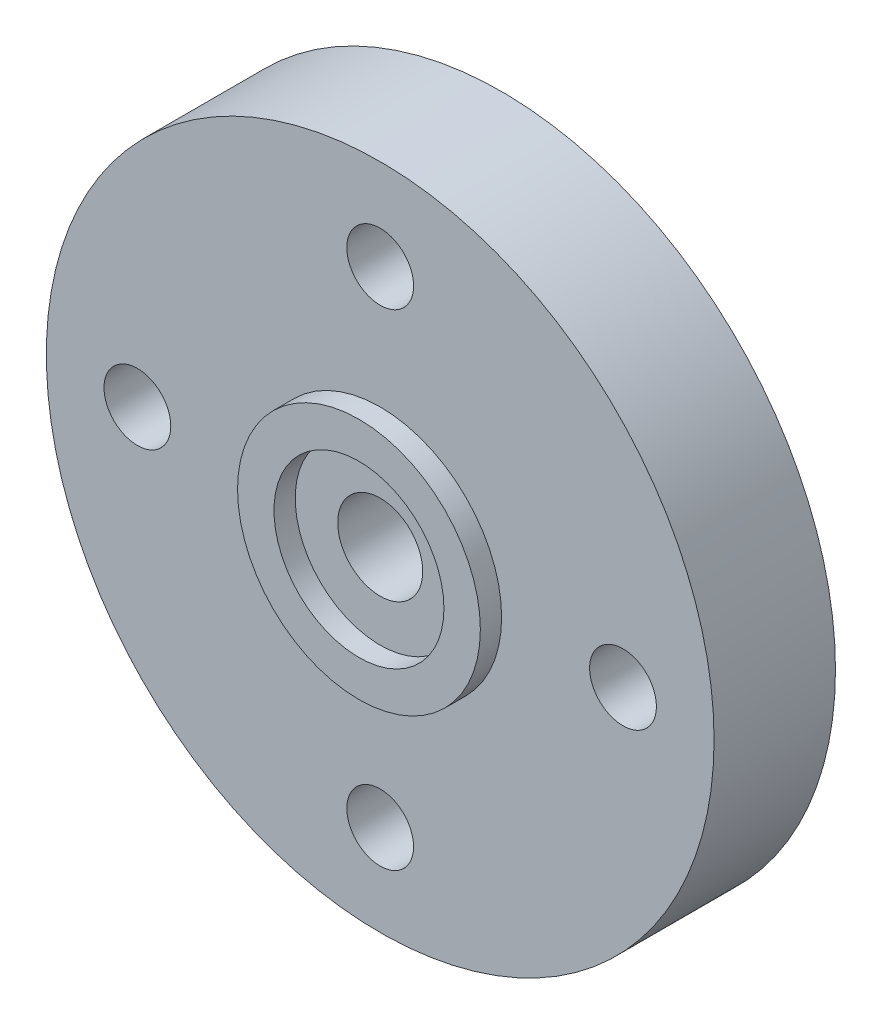
ISO-10303-21;
HEADER;
FILE_DESCRIPTION(('STEP AP214'),'2;1');
FILE_NAME('part.step','',(''),(''),'','','');
FILE_SCHEMA(('AUTOMOTIVE_DESIGN { 1 0 10303 214 1 1 1 1 }'));
ENDSEC;
DATA;
#1=APPLICATION_CONTEXT('core data for automotive mechanical design processes');
#2=APPLICATION_PROTOCOL_DEFINITION('international standard','automotive_design',2000,#1);
#3=PRODUCT_CONTEXT('',#1,'mechanical');
#4=PRODUCT('Part','Part','',(#3));
#5=PRODUCT_RELATED_PRODUCT_CATEGORY('part','',(#4));
#6=PRODUCT_DEFINITION_FORMATION('','',#4);
#7=PRODUCT_DEFINITION_CONTEXT('part definition',#1,'design');
#8=PRODUCT_DEFINITION('design','',#6,#7);
#9=PRODUCT_DEFINITION_SHAPE('','',#8);
#10=(LENGTH_UNIT() NAMED_UNIT(*) SI_UNIT(.MILLI.,.METRE.));
#11=(NAMED_UNIT(*) PLANE_ANGLE_UNIT() SI_UNIT($,.RADIAN.));
#12=(NAMED_UNIT(*) SI_UNIT($,.STERADIAN.) SOLID_ANGLE_UNIT());
#13=UNCERTAINTY_MEASURE_WITH_UNIT(LENGTH_MEASURE(1.E-05),#10,'distance_accuracy_value','');
#14=(GEOMETRIC_REPRESENTATION_CONTEXT(3) GLOBAL_UNCERTAINTY_ASSIGNED_CONTEXT((#13)) GLOBAL_UNIT_ASSIGNED_CONTEXT((#10,
#11,#12)) REPRESENTATION_CONTEXT('',''));
#15=CARTESIAN_POINT('',(0.,0.,0.));
#16=DIRECTION('',(0.,0.,1.));
#17=DIRECTION('',(1.,0.,0.));
#18=AXIS2_PLACEMENT_3D('',#15,#16,#17);
#19=CARTESIAN_POINT('',(0.,0.,4.));
#20=DIRECTION('',(0.,0.,1.));
#21=DIRECTION('',(1.,0.,0.));
#22=AXIS2_PLACEMENT_3D('',#19,#20,#21);
#23=PLANE('',#22);
#24=CARTESIAN_POINT('',(8.,0.,4.));
#25=DIRECTION('',(0.,0.,1.));
#26=DIRECTION('',(1.,0.,0.));
#27=AXIS2_PLACEMENT_3D('',#24,#25,#26);
#28=CIRCLE('',#27,1.1);
#29=CARTESIAN_POINT('',(9.1,0.,4.));
#30=VERTEX_POINT('',#29);
#31=EDGE_CURVE('E56',#30,#30,#28,.T.);
#32=ORIENTED_EDGE('',*,*,#31,.F.);
#33=EDGE_LOOP('',(#32));
#34=FACE_BOUND('',#33,.T.);
#35=CARTESIAN_POINT('',(0.,8.,4.));
#36=DIRECTION('',(0.,0.,1.));
#37=DIRECTION('',(1.,0.,0.));
#38=AXIS2_PLACEMENT_3D('',#35,#36,#37);
#39=CIRCLE('',#38,1.1);
#40=CARTESIAN_POINT('',(1.1,8.,4.));
#41=VERTEX_POINT('',#40);
#42=EDGE_CURVE('E45',#41,#41,#39,.T.);
#43=ORIENTED_EDGE('',*,*,#42,.F.);
#44=EDGE_LOOP('',(#43));
#45=FACE_BOUND('',#44,.T.);
#46=CARTESIAN_POINT('',(0.,0.,4.));
#47=DIRECTION('',(0.,0.,1.));
#48=DIRECTION('',(1.,0.,0.));
#49=AXIS2_PLACEMENT_3D('',#46,#47,#48);
#50=CIRCLE('',#49,11.);
#51=CARTESIAN_POINT('',(11.,0.,4.));
#52=VERTEX_POINT('',#51);
#53=EDGE_CURVE('E36',#52,#52,#50,.T.);
#54=ORIENTED_EDGE('',*,*,#53,.T.);
#55=EDGE_LOOP('',(#54));
#56=FACE_BOUND('',#55,.T.);
#57=CARTESIAN_POINT('',(-8.,0.,4.));
#58=DIRECTION('',(0.,0.,1.));
#59=DIRECTION('',(1.,0.,0.));
#60=AXIS2_PLACEMENT_3D('',#57,#58,#59);
#61=CIRCLE('',#60,1.1);
#62=CARTESIAN_POINT('',(-6.9,0.,4.));
#63=VERTEX_POINT('',#62);
#64=EDGE_CURVE('E50',#63,#63,#61,.T.);
#65=ORIENTED_EDGE('',*,*,#64,.F.);
#66=EDGE_LOOP('',(#65));
#67=FACE_BOUND('',#66,.T.);
#68=CARTESIAN_POINT('',(0.,-8.,4.));
#69=DIRECTION('',(0.,0.,1.));
#70=DIRECTION('',(1.,0.,0.));
#71=AXIS2_PLACEMENT_3D('',#68,#69,#70);
#72=CIRCLE('',#71,1.1);
#73=CARTESIAN_POINT('',(1.1,-8.,4.));
#74=VERTEX_POINT('',#73);
#75=EDGE_CURVE('E62',#74,#74,#72,.T.);
#76=ORIENTED_EDGE('',*,*,#75,.F.);
#77=EDGE_LOOP('',(#76));
#78=FACE_BOUND('',#77,.T.);
#79=CARTESIAN_POINT('',(0.,0.,4.));
#80=DIRECTION('',(0.,0.,1.));
#81=DIRECTION('',(1.,0.,0.));
#82=AXIS2_PLACEMENT_3D('',#79,#80,#81);
#83=CIRCLE('',#82,4.);
#84=CARTESIAN_POINT('',(4.,0.,4.));
#85=VERTEX_POINT('',#84);
#86=EDGE_CURVE('E71',#85,#85,#83,.T.);
#87=ORIENTED_EDGE('',*,*,#86,.F.);
#88=EDGE_LOOP('',(#87));
#89=FACE_BOUND('',#88,.T.);
#90=ADVANCED_FACE('F29',(#34,#45,#56,#67,#78,#89),#23,.T.);
#91=CARTESIAN_POINT('',(0.,0.,0.));
#92=DIRECTION('',(0.,0.,1.));
#93=DIRECTION('',(1.,0.,0.));
#94=AXIS2_PLACEMENT_3D('',#91,#92,#93);
#95=PLANE('',#94);
#96=CARTESIAN_POINT('',(0.,0.,0.));
#97=DIRECTION('',(0.,0.,1.));
#98=DIRECTION('',(1.,0.,0.));
#99=AXIS2_PLACEMENT_3D('',#96,#97,#98);
#100=CIRCLE('',#99,1.4);
#101=CARTESIAN_POINT('',(1.4,0.,0.));
#102=VERTEX_POINT('',#101);
#103=EDGE_CURVE('E79',#102,#102,#100,.F.);
#104=ORIENTED_EDGE('',*,*,#103,.F.);
#105=EDGE_LOOP('',(#104));
#106=FACE_BOUND('',#105,.T.);
#107=CARTESIAN_POINT('',(8.,0.,0.));
#108=DIRECTION('',(0.,0.,1.));
#109=DIRECTION('',(1.,0.,0.));
#110=AXIS2_PLACEMENT_3D('',#107,#108,#109);
#111=CIRCLE('',#110,1.1);
#112=CARTESIAN_POINT('',(9.1,0.,0.));
#113=VERTEX_POINT('',#112);
#114=EDGE_CURVE('E59',#113,#113,#111,.T.);
#115=ORIENTED_EDGE('',*,*,#114,.T.);
#116=EDGE_LOOP('',(#115));
#117=FACE_BOUND('',#116,.T.);
#118=CARTESIAN_POINT('',(0.,8.,0.));
#119=DIRECTION('',(0.,0.,1.));
#120=DIRECTION('',(1.,0.,0.));
#121=AXIS2_PLACEMENT_3D('',#118,#119,#120);
#122=CIRCLE('',#121,1.1);
#123=CARTESIAN_POINT('',(1.1,8.,0.));
#124=VERTEX_POINT('',#123);
#125=EDGE_CURVE('E47',#124,#124,#122,.T.);
#126=ORIENTED_EDGE('',*,*,#125,.T.);
#127=EDGE_LOOP('',(#126));
#128=FACE_BOUND('',#127,.T.);
#129=CARTESIAN_POINT('',(0.,0.,0.));
#130=DIRECTION('',(0.,0.,1.));
#131=DIRECTION('',(1.,0.,0.));
#132=AXIS2_PLACEMENT_3D('',#129,#130,#131);
#133=CIRCLE('',#132,11.);
#134=CARTESIAN_POINT('',(11.,0.,0.));
#135=VERTEX_POINT('',#134);
#136=EDGE_CURVE('E40',#135,#135,#133,.T.);
#137=ORIENTED_EDGE('',*,*,#136,.F.);
#138=EDGE_LOOP('',(#137));
#139=FACE_BOUND('',#138,.T.);
#140=CARTESIAN_POINT('',(-8.,0.,0.));
#141=DIRECTION('',(0.,0.,1.));
#142=DIRECTION('',(1.,0.,0.));
#143=AXIS2_PLACEMENT_3D('',#140,#141,#142);
#144=CIRCLE('',#143,1.1);
#145=CARTESIAN_POINT('',(-6.9,0.,0.));
#146=VERTEX_POINT('',#145);
#147=EDGE_CURVE('E53',#146,#146,#144,.T.);
#148=ORIENTED_EDGE('',*,*,#147,.T.);
#149=EDGE_LOOP('',(#148));
#150=FACE_BOUND('',#149,.T.);
#151=CARTESIAN_POINT('',(0.,-8.,0.));
#152=DIRECTION('',(0.,0.,1.));
#153=DIRECTION('',(1.,0.,0.));
#154=AXIS2_PLACEMENT_3D('',#151,#152,#153);
#155=CIRCLE('',#154,1.1);
#156=CARTESIAN_POINT('',(1.1,-8.,0.));
#157=VERTEX_POINT('',#156);
#158=EDGE_CURVE('E65',#157,#157,#155,.T.);
#159=ORIENTED_EDGE('',*,*,#158,.T.);
#160=EDGE_LOOP('',(#159));
#161=FACE_BOUND('',#160,.T.);
#162=ADVANCED_FACE('F104',(#106,#117,#128,#139,#150,#161),#95,.F.);
#163=CARTESIAN_POINT('',(0.,0.,4.));
#164=DIRECTION('',(0.,0.,-1.));
#165=DIRECTION('',(-1.,0.,0.));
#166=AXIS2_PLACEMENT_3D('',#163,#164,#165);
#167=CYLINDRICAL_SURFACE('',#166,11.);
#168=ORIENTED_EDGE('',*,*,#53,.F.);
#169=EDGE_LOOP('',(#168));
#170=FACE_BOUND('',#169,.T.);
#171=ORIENTED_EDGE('',*,*,#136,.T.);
#172=EDGE_LOOP('',(#171));
#173=FACE_BOUND('',#172,.T.);
#174=ADVANCED_FACE('F31',(#170,#173),#167,.T.);
#175=CARTESIAN_POINT('',(0.,8.,4.));
#176=DIRECTION('',(0.,0.,-1.));
#177=DIRECTION('',(-1.,0.,0.));
#178=AXIS2_PLACEMENT_3D('',#175,#176,#177);
#179=CYLINDRICAL_SURFACE('',#178,1.1);
#180=ORIENTED_EDGE('',*,*,#42,.T.);
#181=EDGE_LOOP('',(#180));
#182=FACE_BOUND('',#181,.T.);
#183=ORIENTED_EDGE('',*,*,#125,.F.);
#184=EDGE_LOOP('',(#183));
#185=FACE_BOUND('',#184,.T.);
#186=ADVANCED_FACE('F141',(#182,#185),#179,.F.);
#187=CARTESIAN_POINT('',(-8.,0.,4.));
#188=DIRECTION('',(0.,0.,-1.));
#189=DIRECTION('',(-1.,0.,0.));
#190=AXIS2_PLACEMENT_3D('',#187,#188,#189);
#191=CYLINDRICAL_SURFACE('',#190,1.1);
#192=ORIENTED_EDGE('',*,*,#64,.T.);
#193=EDGE_LOOP('',(#192));
#194=FACE_BOUND('',#193,.T.);
#195=ORIENTED_EDGE('',*,*,#147,.F.);
#196=EDGE_LOOP('',(#195));
#197=FACE_BOUND('',#196,.T.);
#198=ADVANCED_FACE('F138',(#194,#197),#191,.F.);
#199=CARTESIAN_POINT('',(8.,0.,4.));
#200=DIRECTION('',(0.,0.,-1.));
#201=DIRECTION('',(-1.,0.,0.));
#202=AXIS2_PLACEMENT_3D('',#199,#200,#201);
#203=CYLINDRICAL_SURFACE('',#202,1.1);
#204=ORIENTED_EDGE('',*,*,#31,.T.);
#205=EDGE_LOOP('',(#204));
#206=FACE_BOUND('',#205,.T.);
#207=ORIENTED_EDGE('',*,*,#114,.F.);
#208=EDGE_LOOP('',(#207));
#209=FACE_BOUND('',#208,.T.);
#210=ADVANCED_FACE('F134',(#206,#209),#203,.F.);
#211=CARTESIAN_POINT('',(0.,-8.,4.));
#212=DIRECTION('',(0.,0.,-1.));
#213=DIRECTION('',(-1.,0.,0.));
#214=AXIS2_PLACEMENT_3D('',#211,#212,#213);
#215=CYLINDRICAL_SURFACE('',#214,1.1);
#216=ORIENTED_EDGE('',*,*,#75,.T.);
#217=EDGE_LOOP('',(#216));
#218=FACE_BOUND('',#217,.T.);
#219=ORIENTED_EDGE('',*,*,#158,.F.);
#220=EDGE_LOOP('',(#219));
#221=FACE_BOUND('',#220,.T.);
#222=ADVANCED_FACE('F127',(#218,#221),#215,.F.);
#223=CARTESIAN_POINT('',(0.,0.,4.7));
#224=DIRECTION('',(0.,0.,1.));
#225=DIRECTION('',(1.,0.,0.));
#226=AXIS2_PLACEMENT_3D('',#223,#224,#225);
#227=PLANE('',#226);
#228=CARTESIAN_POINT('',(0.,0.,4.7));
#229=DIRECTION('',(0.,0.,1.));
#230=DIRECTION('',(1.,0.,0.));
#231=AXIS2_PLACEMENT_3D('',#228,#229,#230);
#232=CIRCLE('',#231,4.);
#233=CARTESIAN_POINT('',(4.,0.,4.7));
#234=VERTEX_POINT('',#233);
#235=EDGE_CURVE('E68',#234,#234,#232,.T.);
#236=ORIENTED_EDGE('',*,*,#235,.T.);
#237=EDGE_LOOP('',(#236));
#238=FACE_BOUND('',#237,.T.);
#239=CARTESIAN_POINT('',(0.,0.,4.7));
#240=DIRECTION('',(0.,0.,1.));
#241=DIRECTION('',(1.,0.,0.));
#242=AXIS2_PLACEMENT_3D('',#239,#240,#241);
#243=CIRCLE('',#242,2.8);
#244=CARTESIAN_POINT('',(2.8,0.,4.7));
#245=VERTEX_POINT('',#244);
#246=EDGE_CURVE('E74',#245,#245,#243,.T.);
#247=ORIENTED_EDGE('',*,*,#246,.F.);
#248=EDGE_LOOP('',(#247));
#249=FACE_BOUND('',#248,.T.);
#250=ADVANCED_FACE('F121',(#238,#249),#227,.T.);
#251=CARTESIAN_POINT('',(0.,0.,4.7));
#252=DIRECTION('',(0.,0.,-1.));
#253=DIRECTION('',(-1.,0.,0.));
#254=AXIS2_PLACEMENT_3D('',#251,#252,#253);
#255=CYLINDRICAL_SURFACE('',#254,4.);
#256=ORIENTED_EDGE('',*,*,#235,.F.);
#257=EDGE_LOOP('',(#256));
#258=FACE_BOUND('',#257,.T.);
#259=ORIENTED_EDGE('',*,*,#86,.T.);
#260=EDGE_LOOP('',(#259));
#261=FACE_BOUND('',#260,.T.);
#262=ADVANCED_FACE('F99',(#258,#261),#255,.T.);
#263=CARTESIAN_POINT('',(0.,0.,4.7));
#264=DIRECTION('',(0.,0.,-1.));
#265=DIRECTION('',(-1.,0.,0.));
#266=AXIS2_PLACEMENT_3D('',#263,#264,#265);
#267=CYLINDRICAL_SURFACE('',#266,2.8);
#268=ORIENTED_EDGE('',*,*,#246,.T.);
#269=EDGE_LOOP('',(#268));
#270=FACE_BOUND('',#269,.T.);
#271=CARTESIAN_POINT('',(0.,0.,4.));
#272=DIRECTION('',(0.,0.,1.));
#273=DIRECTION('',(1.,0.,0.));
#274=AXIS2_PLACEMENT_3D('',#271,#272,#273);
#275=CIRCLE('',#274,2.8);
#276=CARTESIAN_POINT('',(2.8,0.,4.));
#277=VERTEX_POINT('',#276);
#278=EDGE_CURVE('E10',#277,#277,#275,.F.);
#279=ORIENTED_EDGE('',*,*,#278,.T.);
#280=EDGE_LOOP('',(#279));
#281=FACE_BOUND('',#280,.T.);
#282=ADVANCED_FACE('F92',(#270,#281),#267,.F.);
#283=CARTESIAN_POINT('',(0.,0.,4.));
#284=DIRECTION('',(0.,0.,1.));
#285=DIRECTION('',(1.,0.,0.));
#286=AXIS2_PLACEMENT_3D('',#283,#284,#285);
#287=CIRCLE('',#286,1.4);
#288=CARTESIAN_POINT('',(1.4,0.,4.));
#289=VERTEX_POINT('',#288);
#290=EDGE_CURVE('E82',#289,#289,#287,.T.);
#291=ORIENTED_EDGE('',*,*,#290,.F.);
#292=EDGE_LOOP('',(#291));
#293=FACE_BOUND('',#292,.T.);
#294=ORIENTED_EDGE('',*,*,#278,.F.);
#295=EDGE_LOOP('',(#294));
#296=FACE_BOUND('',#295,.T.);
#297=ADVANCED_FACE('F89',(#293,#296),#23,.T.);
#298=CARTESIAN_POINT('',(0.,0.,-0.00100000000000013));
#299=DIRECTION('',(0.,0.,1.));
#300=DIRECTION('',(1.,0.,0.));
#301=AXIS2_PLACEMENT_3D('',#298,#299,#300);
#302=CYLINDRICAL_SURFACE('',#301,1.4);
#303=ORIENTED_EDGE('',*,*,#290,.T.);
#304=EDGE_LOOP('',(#303));
#305=FACE_BOUND('',#304,.T.);
#306=ORIENTED_EDGE('',*,*,#103,.T.);
#307=EDGE_LOOP('',(#306));
#308=FACE_BOUND('',#307,.T.);
#309=ADVANCED_FACE('F86',(#305,#308),#302,.F.);
#310=CLOSED_SHELL('',(#90,#162,#174,#186,#198,#210,#222,#250,#262,#282,#297,#309));
#311=MANIFOLD_SOLID_BREP('B2',#310);
#312=ADVANCED_BREP_SHAPE_REPRESENTATION('',(#18,#311),#14);
#313=SHAPE_DEFINITION_REPRESENTATION(#9,#312);
ENDSEC;
END-ISO-10303-21;
